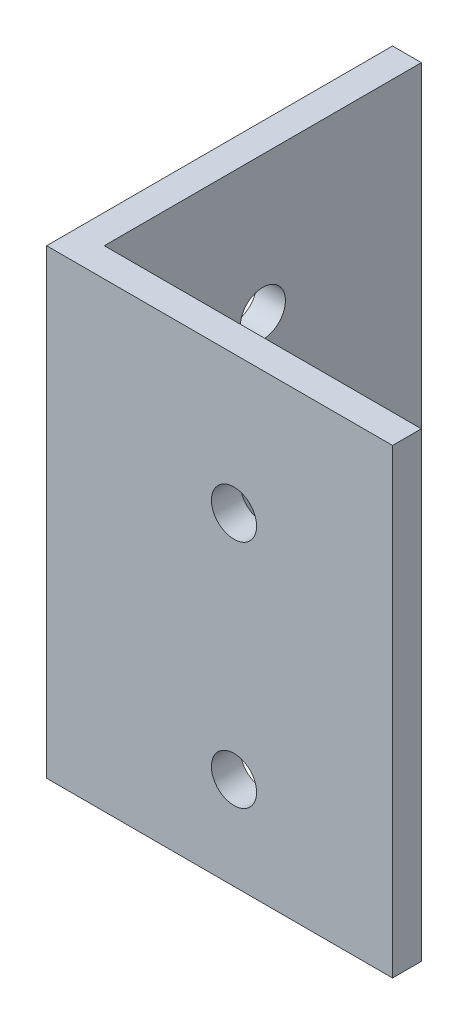
ISO-10303-21;
HEADER;
FILE_DESCRIPTION(('STEP AP214'),'2;1');
FILE_NAME('part.step','',(''),(''),'','','');
FILE_SCHEMA(('AUTOMOTIVE_DESIGN { 1 0 10303 214 1 1 1 1 }'));
ENDSEC;
DATA;
#1=APPLICATION_CONTEXT('core data for automotive mechanical design processes');
#2=APPLICATION_PROTOCOL_DEFINITION('international standard','automotive_design',2000,#1);
#3=PRODUCT_CONTEXT('',#1,'mechanical');
#4=PRODUCT('Part','Part','',(#3));
#5=PRODUCT_RELATED_PRODUCT_CATEGORY('part','',(#4));
#6=PRODUCT_DEFINITION_FORMATION('','',#4);
#7=PRODUCT_DEFINITION_CONTEXT('part definition',#1,'design');
#8=PRODUCT_DEFINITION('design','',#6,#7);
#9=PRODUCT_DEFINITION_SHAPE('','',#8);
#10=(LENGTH_UNIT() NAMED_UNIT(*) SI_UNIT(.MILLI.,.METRE.));
#11=(NAMED_UNIT(*) PLANE_ANGLE_UNIT() SI_UNIT($,.RADIAN.));
#12=(NAMED_UNIT(*) SI_UNIT($,.STERADIAN.) SOLID_ANGLE_UNIT());
#13=UNCERTAINTY_MEASURE_WITH_UNIT(LENGTH_MEASURE(1.E-05),#10,'distance_accuracy_value','');
#14=(GEOMETRIC_REPRESENTATION_CONTEXT(3) GLOBAL_UNCERTAINTY_ASSIGNED_CONTEXT((#13)) GLOBAL_UNIT_ASSIGNED_CONTEXT((#10,
#11,#12)) REPRESENTATION_CONTEXT('',''));
#15=CARTESIAN_POINT('',(0.,0.,0.));
#16=DIRECTION('',(0.,0.,1.));
#17=DIRECTION('',(1.,0.,0.));
#18=AXIS2_PLACEMENT_3D('',#15,#16,#17);
#19=CARTESIAN_POINT('',(0.,25.4,0.));
#20=DIRECTION('',(0.,0.,-1.));
#21=DIRECTION('',(-1.,0.,0.));
#22=AXIS2_PLACEMENT_3D('',#19,#20,#21);
#23=PLANE('',#22);
#24=CARTESIAN_POINT('',(20.6375,10.2108,0.));
#25=DIRECTION('',(0.,0.,-1.));
#26=DIRECTION('',(-1.,0.,0.));
#27=AXIS2_PLACEMENT_3D('',#24,#25,#26);
#28=CIRCLE('',#27,2.4892);
#29=CARTESIAN_POINT('',(18.1483,10.2108,0.));
#30=VERTEX_POINT('',#29);
#31=EDGE_CURVE('E121',#30,#30,#28,.T.);
#32=ORIENTED_EDGE('',*,*,#31,.T.);
#33=EDGE_LOOP('',(#32));
#34=FACE_BOUND('',#33,.T.);
#35=CARTESIAN_POINT('',(20.6375,-15.1892,0.));
#36=DIRECTION('',(0.,0.,-1.));
#37=DIRECTION('',(-1.,0.,0.));
#38=AXIS2_PLACEMENT_3D('',#35,#36,#37);
#39=CIRCLE('',#38,2.4892);
#40=CARTESIAN_POINT('',(18.1483,-15.1892,0.));
#41=VERTEX_POINT('',#40);
#42=EDGE_CURVE('E167',#41,#41,#39,.T.);
#43=ORIENTED_EDGE('',*,*,#42,.T.);
#44=EDGE_LOOP('',(#43));
#45=FACE_BOUND('',#44,.T.);
#46=DIRECTION('',(1.,0.,0.));
#47=VECTOR('',#46,1.);
#48=CARTESIAN_POINT('',(0.,-25.4,0.));
#49=LINE('',#48,#47);
#50=CARTESIAN_POINT('',(0.,-25.4,0.));
#51=VERTEX_POINT('',#50);
#52=CARTESIAN_POINT('',(38.1,-25.4,0.));
#53=VERTEX_POINT('',#52);
#54=EDGE_CURVE('E117',#51,#53,#49,.T.);
#55=ORIENTED_EDGE('',*,*,#54,.T.);
#56=DIRECTION('',(0.,-1.,0.));
#57=VECTOR('',#56,1.);
#58=CARTESIAN_POINT('',(38.1,25.4,0.));
#59=LINE('',#58,#57);
#60=CARTESIAN_POINT('',(38.1,25.4,0.));
#61=VERTEX_POINT('',#60);
#62=EDGE_CURVE('E11',#61,#53,#59,.T.);
#63=ORIENTED_EDGE('',*,*,#62,.F.);
#64=DIRECTION('',(1.,0.,0.));
#65=VECTOR('',#64,1.);
#66=CARTESIAN_POINT('',(0.,25.4,0.));
#67=LINE('',#66,#65);
#68=CARTESIAN_POINT('',(0.,25.4,0.));
#69=VERTEX_POINT('',#68);
#70=EDGE_CURVE('E82',#69,#61,#67,.T.);
#71=ORIENTED_EDGE('',*,*,#70,.F.);
#72=DIRECTION('',(0.,-1.,0.));
#73=VECTOR('',#72,1.);
#74=CARTESIAN_POINT('',(0.,25.4,0.));
#75=LINE('',#74,#73);
#76=EDGE_CURVE('E113',#69,#51,#75,.T.);
#77=ORIENTED_EDGE('',*,*,#76,.T.);
#78=EDGE_LOOP('',(#55,#63,#71,#77));
#79=FACE_BOUND('',#78,.T.);
#80=ADVANCED_FACE('F36',(#34,#45,#79),#23,.F.);
#81=CARTESIAN_POINT('',(38.1,25.4,-3.175));
#82=DIRECTION('',(1.,0.,0.));
#83=DIRECTION('',(0.,0.,-1.));
#84=AXIS2_PLACEMENT_3D('',#81,#82,#83);
#85=PLANE('',#84);
#86=DIRECTION('',(0.,0.,1.));
#87=VECTOR('',#86,1.);
#88=CARTESIAN_POINT('',(38.1,-25.4,-3.175));
#89=LINE('',#88,#87);
#90=CARTESIAN_POINT('',(38.1,-25.4,-3.175));
#91=VERTEX_POINT('',#90);
#92=EDGE_CURVE('E120',#91,#53,#89,.T.);
#93=ORIENTED_EDGE('',*,*,#92,.F.);
#94=DIRECTION('',(0.,-1.,0.));
#95=VECTOR('',#94,1.);
#96=CARTESIAN_POINT('',(38.1,25.4,-3.175));
#97=LINE('',#96,#95);
#98=CARTESIAN_POINT('',(38.1,25.4,-3.175));
#99=VERTEX_POINT('',#98);
#100=EDGE_CURVE('E44',#99,#91,#97,.T.);
#101=ORIENTED_EDGE('',*,*,#100,.F.);
#102=DIRECTION('',(0.,0.,1.));
#103=VECTOR('',#102,1.);
#104=CARTESIAN_POINT('',(38.1,25.4,-3.175));
#105=LINE('',#104,#103);
#106=EDGE_CURVE('E180',#99,#61,#105,.T.);
#107=ORIENTED_EDGE('',*,*,#106,.T.);
#108=ORIENTED_EDGE('',*,*,#62,.T.);
#109=EDGE_LOOP('',(#93,#101,#107,#108));
#110=FACE_BOUND('',#109,.T.);
#111=ADVANCED_FACE('F139',(#110),#85,.T.);
#112=CARTESIAN_POINT('',(0.,25.4,-3.175));
#113=DIRECTION('',(0.,0.,-1.));
#114=DIRECTION('',(-1.,0.,0.));
#115=AXIS2_PLACEMENT_3D('',#112,#113,#114);
#116=PLANE('',#115);
#117=CARTESIAN_POINT('',(20.6375,10.2108,-3.175));
#118=DIRECTION('',(0.,0.,-1.));
#119=DIRECTION('',(-1.,0.,0.));
#120=AXIS2_PLACEMENT_3D('',#117,#118,#119);
#121=CIRCLE('',#120,2.4892);
#122=CARTESIAN_POINT('',(18.1483,10.2108,-3.175));
#123=VERTEX_POINT('',#122);
#124=EDGE_CURVE('E169',#123,#123,#121,.T.);
#125=ORIENTED_EDGE('',*,*,#124,.F.);
#126=EDGE_LOOP('',(#125));
#127=FACE_BOUND('',#126,.T.);
#128=CARTESIAN_POINT('',(20.6375,-15.1892,-3.175));
#129=DIRECTION('',(0.,0.,-1.));
#130=DIRECTION('',(-1.,0.,0.));
#131=AXIS2_PLACEMENT_3D('',#128,#129,#130);
#132=CIRCLE('',#131,2.4892);
#133=CARTESIAN_POINT('',(18.1483,-15.1892,-3.175));
#134=VERTEX_POINT('',#133);
#135=EDGE_CURVE('E170',#134,#134,#132,.T.);
#136=ORIENTED_EDGE('',*,*,#135,.F.);
#137=EDGE_LOOP('',(#136));
#138=FACE_BOUND('',#137,.T.);
#139=DIRECTION('',(1.,0.,0.));
#140=VECTOR('',#139,1.);
#141=CARTESIAN_POINT('',(0.,-25.4,-3.175));
#142=LINE('',#141,#140);
#143=CARTESIAN_POINT('',(3.175,-25.4,-3.175));
#144=VERTEX_POINT('',#143);
#145=EDGE_CURVE('E124',#144,#91,#142,.T.);
#146=ORIENTED_EDGE('',*,*,#145,.F.);
#147=DIRECTION('',(0.,-1.,0.));
#148=VECTOR('',#147,1.);
#149=CARTESIAN_POINT('',(3.175,25.4,-3.175));
#150=LINE('',#149,#148);
#151=CARTESIAN_POINT('',(3.175,25.4,-3.175));
#152=VERTEX_POINT('',#151);
#153=EDGE_CURVE('E103',#152,#144,#150,.T.);
#154=ORIENTED_EDGE('',*,*,#153,.F.);
#155=DIRECTION('',(1.,0.,0.));
#156=VECTOR('',#155,1.);
#157=CARTESIAN_POINT('',(0.,25.4,-3.175));
#158=LINE('',#157,#156);
#159=EDGE_CURVE('E109',#152,#99,#158,.T.);
#160=ORIENTED_EDGE('',*,*,#159,.T.);
#161=ORIENTED_EDGE('',*,*,#100,.T.);
#162=EDGE_LOOP('',(#146,#154,#160,#161));
#163=FACE_BOUND('',#162,.T.);
#164=ADVANCED_FACE('F136',(#127,#138,#163),#116,.T.);
#165=CARTESIAN_POINT('',(3.175,25.4,-38.1));
#166=DIRECTION('',(1.,0.,0.));
#167=DIRECTION('',(0.,0.,-1.));
#168=AXIS2_PLACEMENT_3D('',#165,#166,#167);
#169=PLANE('',#168);
#170=CARTESIAN_POINT('',(3.175,10.2108,-20.6375));
#171=DIRECTION('',(-1.,0.,0.));
#172=DIRECTION('',(0.,0.,1.));
#173=AXIS2_PLACEMENT_3D('',#170,#171,#172);
#174=CIRCLE('',#173,2.4892);
#175=CARTESIAN_POINT('',(3.175,10.2108,-18.1483));
#176=VERTEX_POINT('',#175);
#177=EDGE_CURVE('E188',#176,#176,#174,.T.);
#178=ORIENTED_EDGE('',*,*,#177,.T.);
#179=EDGE_LOOP('',(#178));
#180=FACE_BOUND('',#179,.T.);
#181=CARTESIAN_POINT('',(3.175,-15.1892,-20.6375));
#182=DIRECTION('',(-1.,0.,0.));
#183=DIRECTION('',(0.,0.,1.));
#184=AXIS2_PLACEMENT_3D('',#181,#182,#183);
#185=CIRCLE('',#184,2.4892);
#186=CARTESIAN_POINT('',(3.175,-15.1892,-18.1483));
#187=VERTEX_POINT('',#186);
#188=EDGE_CURVE('E182',#187,#187,#185,.T.);
#189=ORIENTED_EDGE('',*,*,#188,.T.);
#190=EDGE_LOOP('',(#189));
#191=FACE_BOUND('',#190,.T.);
#192=DIRECTION('',(0.,0.,-1.));
#193=VECTOR('',#192,1.);
#194=CARTESIAN_POINT('',(3.175,-25.4,-38.1));
#195=LINE('',#194,#193);
#196=CARTESIAN_POINT('',(3.175,-25.4,-38.1));
#197=VERTEX_POINT('',#196);
#198=EDGE_CURVE('E98',#197,#144,#195,.F.);
#199=ORIENTED_EDGE('',*,*,#198,.F.);
#200=DIRECTION('',(0.,-1.,0.));
#201=VECTOR('',#200,1.);
#202=CARTESIAN_POINT('',(3.175,25.4,-38.1));
#203=LINE('',#202,#201);
#204=CARTESIAN_POINT('',(3.175,25.4,-38.1));
#205=VERTEX_POINT('',#204);
#206=EDGE_CURVE('E93',#205,#197,#203,.T.);
#207=ORIENTED_EDGE('',*,*,#206,.F.);
#208=DIRECTION('',(0.,0.,-1.));
#209=VECTOR('',#208,1.);
#210=CARTESIAN_POINT('',(3.175,25.4,-38.1));
#211=LINE('',#210,#209);
#212=EDGE_CURVE('E96',#205,#152,#211,.F.);
#213=ORIENTED_EDGE('',*,*,#212,.T.);
#214=ORIENTED_EDGE('',*,*,#153,.T.);
#215=EDGE_LOOP('',(#199,#207,#213,#214));
#216=FACE_BOUND('',#215,.T.);
#217=ADVANCED_FACE('F95',(#180,#191,#216),#169,.T.);
#218=CARTESIAN_POINT('',(0.,25.4,-38.1));
#219=DIRECTION('',(0.,0.,-1.));
#220=DIRECTION('',(-1.,0.,0.));
#221=AXIS2_PLACEMENT_3D('',#218,#219,#220);
#222=PLANE('',#221);
#223=DIRECTION('',(1.,0.,0.));
#224=VECTOR('',#223,1.);
#225=CARTESIAN_POINT('',(0.,-25.4,-38.1));
#226=LINE('',#225,#224);
#227=CARTESIAN_POINT('',(0.,-25.4,-38.1));
#228=VERTEX_POINT('',#227);
#229=EDGE_CURVE('E128',#228,#197,#226,.T.);
#230=ORIENTED_EDGE('',*,*,#229,.F.);
#231=DIRECTION('',(0.,-1.,0.));
#232=VECTOR('',#231,1.);
#233=CARTESIAN_POINT('',(0.,25.4,-38.1));
#234=LINE('',#233,#232);
#235=CARTESIAN_POINT('',(0.,25.4,-38.1));
#236=VERTEX_POINT('',#235);
#237=EDGE_CURVE('E73',#236,#228,#234,.T.);
#238=ORIENTED_EDGE('',*,*,#237,.F.);
#239=DIRECTION('',(1.,0.,0.));
#240=VECTOR('',#239,1.);
#241=CARTESIAN_POINT('',(0.,25.4,-38.1));
#242=LINE('',#241,#240);
#243=EDGE_CURVE('E107',#236,#205,#242,.T.);
#244=ORIENTED_EDGE('',*,*,#243,.T.);
#245=ORIENTED_EDGE('',*,*,#206,.T.);
#246=EDGE_LOOP('',(#230,#238,#244,#245));
#247=FACE_BOUND('',#246,.T.);
#248=ADVANCED_FACE('F111',(#247),#222,.T.);
#249=CARTESIAN_POINT('',(0.,25.4,-38.1));
#250=DIRECTION('',(1.,0.,0.));
#251=DIRECTION('',(0.,0.,-1.));
#252=AXIS2_PLACEMENT_3D('',#249,#250,#251);
#253=PLANE('',#252);
#254=CARTESIAN_POINT('',(0.,10.2108,-20.6375));
#255=DIRECTION('',(-1.,0.,0.));
#256=DIRECTION('',(0.,0.,1.));
#257=AXIS2_PLACEMENT_3D('',#254,#255,#256);
#258=CIRCLE('',#257,2.4892);
#259=CARTESIAN_POINT('',(0.,10.2108,-18.1483));
#260=VERTEX_POINT('',#259);
#261=EDGE_CURVE('E175',#260,#260,#258,.T.);
#262=ORIENTED_EDGE('',*,*,#261,.F.);
#263=EDGE_LOOP('',(#262));
#264=FACE_BOUND('',#263,.T.);
#265=CARTESIAN_POINT('',(0.,-15.1892,-20.6375));
#266=DIRECTION('',(-1.,0.,0.));
#267=DIRECTION('',(0.,0.,1.));
#268=AXIS2_PLACEMENT_3D('',#265,#266,#267);
#269=CIRCLE('',#268,2.4892);
#270=CARTESIAN_POINT('',(0.,-15.1892,-18.1483));
#271=VERTEX_POINT('',#270);
#272=EDGE_CURVE('E185',#271,#271,#269,.T.);
#273=ORIENTED_EDGE('',*,*,#272,.F.);
#274=EDGE_LOOP('',(#273));
#275=FACE_BOUND('',#274,.T.);
#276=DIRECTION('',(0.,0.,1.));
#277=VECTOR('',#276,1.);
#278=CARTESIAN_POINT('',(0.,-25.4,-38.1));
#279=LINE('',#278,#277);
#280=EDGE_CURVE('E76',#228,#51,#279,.T.);
#281=ORIENTED_EDGE('',*,*,#280,.T.);
#282=ORIENTED_EDGE('',*,*,#76,.F.);
#283=DIRECTION('',(0.,0.,1.));
#284=VECTOR('',#283,1.);
#285=CARTESIAN_POINT('',(0.,25.4,-38.1));
#286=LINE('',#285,#284);
#287=EDGE_CURVE('E52',#236,#69,#286,.T.);
#288=ORIENTED_EDGE('',*,*,#287,.F.);
#289=ORIENTED_EDGE('',*,*,#237,.T.);
#290=EDGE_LOOP('',(#281,#282,#288,#289));
#291=FACE_BOUND('',#290,.T.);
#292=ADVANCED_FACE('F144',(#264,#275,#291),#253,.F.);
#293=CARTESIAN_POINT('',(0.,25.4,0.));
#294=DIRECTION('',(0.,-1.,0.));
#295=DIRECTION('',(-1.,0.,0.));
#296=AXIS2_PLACEMENT_3D('',#293,#294,#295);
#297=PLANE('',#296);
#298=ORIENTED_EDGE('',*,*,#70,.T.);
#299=ORIENTED_EDGE('',*,*,#106,.F.);
#300=ORIENTED_EDGE('',*,*,#159,.F.);
#301=ORIENTED_EDGE('',*,*,#212,.F.);
#302=ORIENTED_EDGE('',*,*,#243,.F.);
#303=ORIENTED_EDGE('',*,*,#287,.T.);
#304=EDGE_LOOP('',(#298,#299,#300,#301,#302,#303));
#305=FACE_BOUND('',#304,.T.);
#306=ADVANCED_FACE('F106',(#305),#297,.F.);
#307=CARTESIAN_POINT('',(0.,-25.4,0.));
#308=DIRECTION('',(0.,-1.,0.));
#309=DIRECTION('',(-1.,0.,0.));
#310=AXIS2_PLACEMENT_3D('',#307,#308,#309);
#311=PLANE('',#310);
#312=ORIENTED_EDGE('',*,*,#54,.F.);
#313=ORIENTED_EDGE('',*,*,#280,.F.);
#314=ORIENTED_EDGE('',*,*,#229,.T.);
#315=ORIENTED_EDGE('',*,*,#198,.T.);
#316=ORIENTED_EDGE('',*,*,#145,.T.);
#317=ORIENTED_EDGE('',*,*,#92,.T.);
#318=EDGE_LOOP('',(#312,#313,#314,#315,#316,#317));
#319=FACE_BOUND('',#318,.T.);
#320=ADVANCED_FACE('F142',(#319),#311,.T.);
#321=CARTESIAN_POINT('',(20.6375,-15.1892,0.));
#322=DIRECTION('',(0.,0.,-1.));
#323=DIRECTION('',(-1.,0.,0.));
#324=AXIS2_PLACEMENT_3D('',#321,#322,#323);
#325=CYLINDRICAL_SURFACE('',#324,2.4892);
#326=ORIENTED_EDGE('',*,*,#42,.F.);
#327=EDGE_LOOP('',(#326));
#328=FACE_BOUND('',#327,.T.);
#329=ORIENTED_EDGE('',*,*,#135,.T.);
#330=EDGE_LOOP('',(#329));
#331=FACE_BOUND('',#330,.T.);
#332=ADVANCED_FACE('F212',(#328,#331),#325,.F.);
#333=CARTESIAN_POINT('',(20.6375,10.2108,0.));
#334=DIRECTION('',(0.,0.,-1.));
#335=DIRECTION('',(-1.,0.,0.));
#336=AXIS2_PLACEMENT_3D('',#333,#334,#335);
#337=CYLINDRICAL_SURFACE('',#336,2.4892);
#338=ORIENTED_EDGE('',*,*,#31,.F.);
#339=EDGE_LOOP('',(#338));
#340=FACE_BOUND('',#339,.T.);
#341=ORIENTED_EDGE('',*,*,#124,.T.);
#342=EDGE_LOOP('',(#341));
#343=FACE_BOUND('',#342,.T.);
#344=ADVANCED_FACE('F206',(#340,#343),#337,.F.);
#345=CARTESIAN_POINT('',(0.,-15.1892,-20.6375));
#346=DIRECTION('',(1.,0.,0.));
#347=DIRECTION('',(0.,0.,-1.));
#348=AXIS2_PLACEMENT_3D('',#345,#346,#347);
#349=CYLINDRICAL_SURFACE('',#348,2.4892);
#350=ORIENTED_EDGE('',*,*,#272,.T.);
#351=EDGE_LOOP('',(#350));
#352=FACE_BOUND('',#351,.T.);
#353=ORIENTED_EDGE('',*,*,#188,.F.);
#354=EDGE_LOOP('',(#353));
#355=FACE_BOUND('',#354,.T.);
#356=ADVANCED_FACE('F196',(#352,#355),#349,.F.);
#357=CARTESIAN_POINT('',(0.,10.2108,-20.6375));
#358=DIRECTION('',(1.,0.,0.));
#359=DIRECTION('',(0.,0.,-1.));
#360=AXIS2_PLACEMENT_3D('',#357,#358,#359);
#361=CYLINDRICAL_SURFACE('',#360,2.4892);
#362=ORIENTED_EDGE('',*,*,#261,.T.);
#363=EDGE_LOOP('',(#362));
#364=FACE_BOUND('',#363,.T.);
#365=ORIENTED_EDGE('',*,*,#177,.F.);
#366=EDGE_LOOP('',(#365));
#367=FACE_BOUND('',#366,.T.);
#368=ADVANCED_FACE('F193',(#364,#367),#361,.F.);
#369=CLOSED_SHELL('',(#80,#111,#164,#217,#248,#292,#306,#320,#332,#344,#356,#368));
#370=MANIFOLD_SOLID_BREP('B2',#369);
#371=ADVANCED_BREP_SHAPE_REPRESENTATION('',(#18,#370),#14);
#372=SHAPE_DEFINITION_REPRESENTATION(#9,#371);
ENDSEC;
END-ISO-10303-21;
